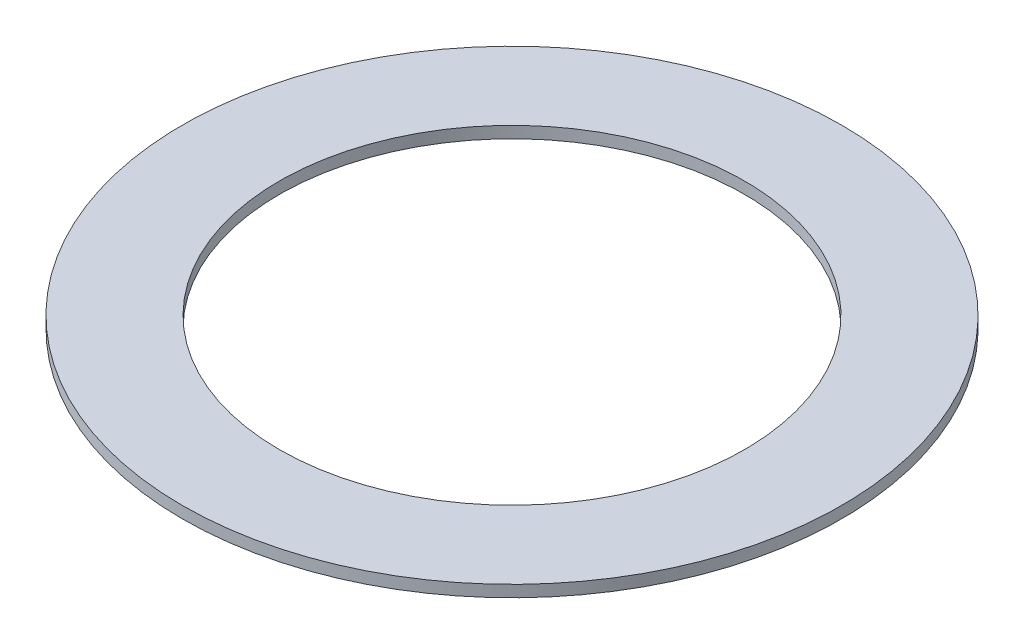
ISO-10303-21;
HEADER;
FILE_DESCRIPTION(('STEP AP214'),'2;1');
FILE_NAME('part.step','',(''),(''),'','','');
FILE_SCHEMA(('AUTOMOTIVE_DESIGN { 1 0 10303 214 1 1 1 1 }'));
ENDSEC;
DATA;
#1=APPLICATION_CONTEXT('core data for automotive mechanical design processes');
#2=APPLICATION_PROTOCOL_DEFINITION('international standard','automotive_design',2000,#1);
#3=PRODUCT_CONTEXT('',#1,'mechanical');
#4=PRODUCT('Part','Part','',(#3));
#5=PRODUCT_RELATED_PRODUCT_CATEGORY('part','',(#4));
#6=PRODUCT_DEFINITION_FORMATION('','',#4);
#7=PRODUCT_DEFINITION_CONTEXT('part definition',#1,'design');
#8=PRODUCT_DEFINITION('design','',#6,#7);
#9=PRODUCT_DEFINITION_SHAPE('','',#8);
#10=(LENGTH_UNIT() NAMED_UNIT(*) SI_UNIT(.MILLI.,.METRE.));
#11=(NAMED_UNIT(*) PLANE_ANGLE_UNIT() SI_UNIT($,.RADIAN.));
#12=(NAMED_UNIT(*) SI_UNIT($,.STERADIAN.) SOLID_ANGLE_UNIT());
#13=UNCERTAINTY_MEASURE_WITH_UNIT(LENGTH_MEASURE(1.E-05),#10,'distance_accuracy_value','');
#14=(GEOMETRIC_REPRESENTATION_CONTEXT(3) GLOBAL_UNCERTAINTY_ASSIGNED_CONTEXT((#13)) GLOBAL_UNIT_ASSIGNED_CONTEXT((#10,
#11,#12)) REPRESENTATION_CONTEXT('',''));
#15=CARTESIAN_POINT('',(0.,0.,0.));
#16=DIRECTION('',(0.,0.,1.));
#17=DIRECTION('',(1.,0.,0.));
#18=AXIS2_PLACEMENT_3D('',#15,#16,#17);
#19=CARTESIAN_POINT('',(0.,1.905,0.));
#20=DIRECTION('',(0.,1.,0.));
#21=DIRECTION('',(0.,0.,1.));
#22=AXIS2_PLACEMENT_3D('',#19,#20,#21);
#23=PLANE('',#22);
#24=CARTESIAN_POINT('',(0.,1.905,0.));
#25=DIRECTION('',(0.,1.,0.));
#26=DIRECTION('',(0.,0.,1.));
#27=AXIS2_PLACEMENT_3D('',#24,#25,#26);
#28=CIRCLE('',#27,53.975);
#29=CARTESIAN_POINT('',(0.,1.905,53.975));
#30=VERTEX_POINT('',#29);
#31=EDGE_CURVE('E10',#30,#30,#28,.T.);
#32=ORIENTED_EDGE('',*,*,#31,.T.);
#33=EDGE_LOOP('',(#32));
#34=FACE_BOUND('',#33,.T.);
#35=CARTESIAN_POINT('',(0.,1.905,0.));
#36=DIRECTION('',(0.,1.,0.));
#37=DIRECTION('',(0.,0.,1.));
#38=AXIS2_PLACEMENT_3D('',#35,#36,#37);
#39=CIRCLE('',#38,38.1);
#40=CARTESIAN_POINT('',(0.,1.905,38.1));
#41=VERTEX_POINT('',#40);
#42=EDGE_CURVE('E42',#41,#41,#39,.T.);
#43=ORIENTED_EDGE('',*,*,#42,.F.);
#44=EDGE_LOOP('',(#43));
#45=FACE_BOUND('',#44,.T.);
#46=ADVANCED_FACE('F31',(#34,#45),#23,.T.);
#47=CARTESIAN_POINT('',(0.,0.,0.));
#48=DIRECTION('',(0.,1.,0.));
#49=DIRECTION('',(0.,0.,1.));
#50=AXIS2_PLACEMENT_3D('',#47,#48,#49);
#51=PLANE('',#50);
#52=CARTESIAN_POINT('',(0.,0.,0.));
#53=DIRECTION('',(0.,1.,0.));
#54=DIRECTION('',(0.,0.,1.));
#55=AXIS2_PLACEMENT_3D('',#52,#53,#54);
#56=CIRCLE('',#55,53.975);
#57=CARTESIAN_POINT('',(0.,0.,53.975));
#58=VERTEX_POINT('',#57);
#59=EDGE_CURVE('E35',#58,#58,#56,.T.);
#60=ORIENTED_EDGE('',*,*,#59,.F.);
#61=EDGE_LOOP('',(#60));
#62=FACE_BOUND('',#61,.T.);
#63=CARTESIAN_POINT('',(0.,0.,0.));
#64=DIRECTION('',(0.,1.,0.));
#65=DIRECTION('',(0.,0.,1.));
#66=AXIS2_PLACEMENT_3D('',#63,#64,#65);
#67=CIRCLE('',#66,38.1);
#68=CARTESIAN_POINT('',(0.,0.,38.1));
#69=VERTEX_POINT('',#68);
#70=EDGE_CURVE('E44',#69,#69,#67,.T.);
#71=ORIENTED_EDGE('',*,*,#70,.T.);
#72=EDGE_LOOP('',(#71));
#73=FACE_BOUND('',#72,.T.);
#74=ADVANCED_FACE('F54',(#62,#73),#51,.F.);
#75=CARTESIAN_POINT('',(0.,1.905,0.));
#76=DIRECTION('',(0.,-1.,0.));
#77=DIRECTION('',(0.,0.,-1.));
#78=AXIS2_PLACEMENT_3D('',#75,#76,#77);
#79=CYLINDRICAL_SURFACE('',#78,53.975);
#80=ORIENTED_EDGE('',*,*,#31,.F.);
#81=EDGE_LOOP('',(#80));
#82=FACE_BOUND('',#81,.T.);
#83=ORIENTED_EDGE('',*,*,#59,.T.);
#84=EDGE_LOOP('',(#83));
#85=FACE_BOUND('',#84,.T.);
#86=ADVANCED_FACE('F33',(#82,#85),#79,.T.);
#87=CARTESIAN_POINT('',(0.,1.905,0.));
#88=DIRECTION('',(0.,-1.,0.));
#89=DIRECTION('',(0.,0.,-1.));
#90=AXIS2_PLACEMENT_3D('',#87,#88,#89);
#91=CYLINDRICAL_SURFACE('',#90,38.1);
#92=ORIENTED_EDGE('',*,*,#42,.T.);
#93=EDGE_LOOP('',(#92));
#94=FACE_BOUND('',#93,.T.);
#95=ORIENTED_EDGE('',*,*,#70,.F.);
#96=EDGE_LOOP('',(#95));
#97=FACE_BOUND('',#96,.T.);
#98=ADVANCED_FACE('F50',(#94,#97),#91,.F.);
#99=CLOSED_SHELL('',(#46,#74,#86,#98));
#100=MANIFOLD_SOLID_BREP('B2',#99);
#101=ADVANCED_BREP_SHAPE_REPRESENTATION('',(#18,#100),#14);
#102=SHAPE_DEFINITION_REPRESENTATION(#9,#101);
ENDSEC;
END-ISO-10303-21;
